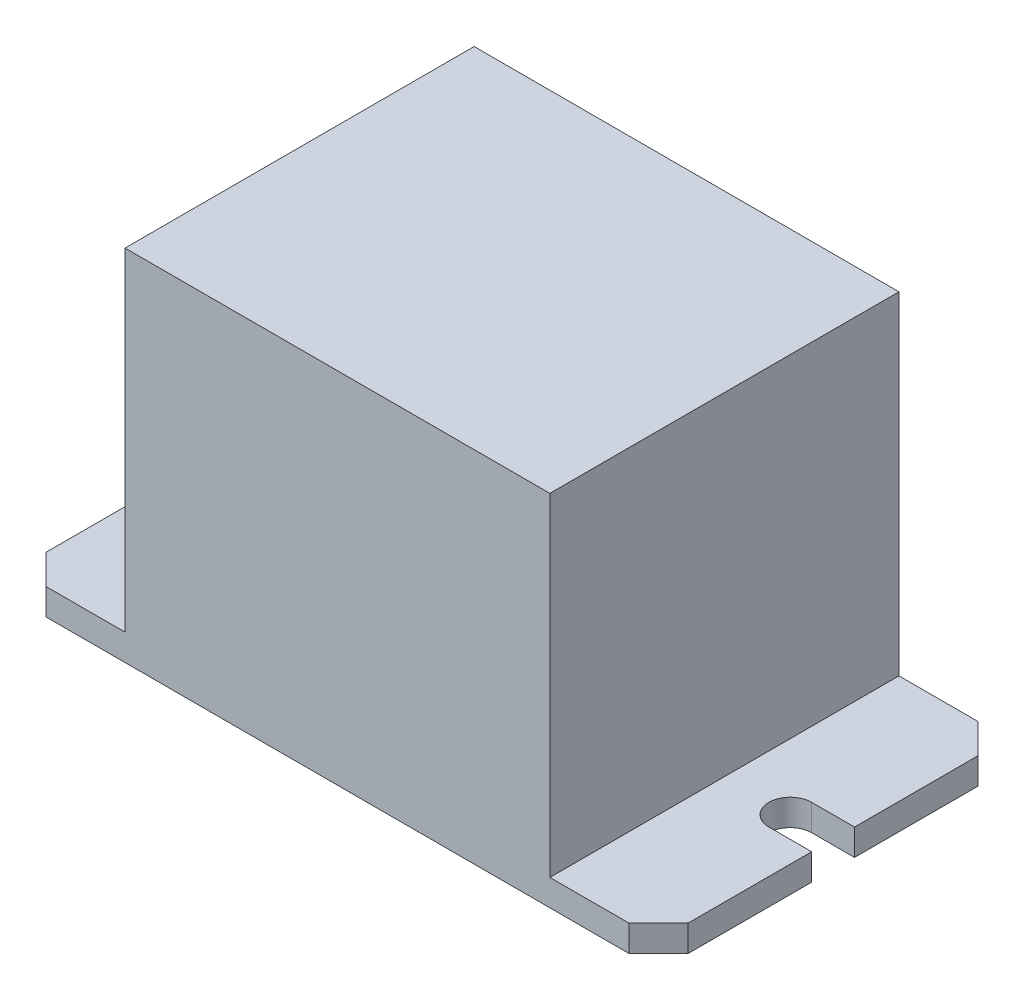
ISO-10303-21;
HEADER;
FILE_DESCRIPTION(('STEP AP214'),'2;1');
FILE_NAME('part.step','',(''),(''),'','','');
FILE_SCHEMA(('AUTOMOTIVE_DESIGN { 1 0 10303 214 1 1 1 1 }'));
ENDSEC;
DATA;
#1=APPLICATION_CONTEXT('core data for automotive mechanical design processes');
#2=APPLICATION_PROTOCOL_DEFINITION('international standard','automotive_design',2000,#1);
#3=PRODUCT_CONTEXT('',#1,'mechanical');
#4=PRODUCT('Part','Part','',(#3));
#5=PRODUCT_RELATED_PRODUCT_CATEGORY('part','',(#4));
#6=PRODUCT_DEFINITION_FORMATION('','',#4);
#7=PRODUCT_DEFINITION_CONTEXT('part definition',#1,'design');
#8=PRODUCT_DEFINITION('design','',#6,#7);
#9=PRODUCT_DEFINITION_SHAPE('','',#8);
#10=(LENGTH_UNIT() NAMED_UNIT(*) SI_UNIT(.MILLI.,.METRE.));
#11=(NAMED_UNIT(*) PLANE_ANGLE_UNIT() SI_UNIT($,.RADIAN.));
#12=(NAMED_UNIT(*) SI_UNIT($,.STERADIAN.) SOLID_ANGLE_UNIT());
#13=UNCERTAINTY_MEASURE_WITH_UNIT(LENGTH_MEASURE(1.E-05),#10,'distance_accuracy_value','');
#14=(GEOMETRIC_REPRESENTATION_CONTEXT(3) GLOBAL_UNCERTAINTY_ASSIGNED_CONTEXT((#13)) GLOBAL_UNIT_ASSIGNED_CONTEXT((#10,
#11,#12)) REPRESENTATION_CONTEXT('',''));
#15=CARTESIAN_POINT('',(0.,0.,0.));
#16=DIRECTION('',(0.,0.,1.));
#17=DIRECTION('',(1.,0.,0.));
#18=AXIS2_PLACEMENT_3D('',#15,#16,#17);
#19=CARTESIAN_POINT('',(-18.0292306975485,27.686,13.5258599301605));
#20=DIRECTION('',(0.,0.,-1.));
#21=DIRECTION('',(-1.,0.,0.));
#22=AXIS2_PLACEMENT_3D('',#19,#20,#21);
#23=PLANE('',#22);
#24=DIRECTION('',(1.,0.,0.));
#25=VECTOR('',#24,1.);
#26=CARTESIAN_POINT('',(-18.0292306975485,0.,13.5258599301605));
#27=LINE('',#26,#25);
#28=CARTESIAN_POINT('',(-24.1252306975485,0.,13.5258599301605));
#29=VERTEX_POINT('',#28);
#30=CARTESIAN_POINT('',(20.8327693024515,0.,13.5258599301605));
#31=VERTEX_POINT('',#30);
#32=EDGE_CURVE('E319',#29,#31,#27,.T.);
#33=ORIENTED_EDGE('',*,*,#32,.T.);
#34=DIRECTION('',(0.,-1.,0.));
#35=VECTOR('',#34,1.);
#36=CARTESIAN_POINT('',(20.8327693024515,2.032,13.5258599301605));
#37=LINE('',#36,#35);
#38=CARTESIAN_POINT('',(20.8327693024515,2.032,13.5258599301605));
#39=VERTEX_POINT('',#38);
#40=EDGE_CURVE('E248',#39,#31,#37,.T.);
#41=ORIENTED_EDGE('',*,*,#40,.F.);
#42=DIRECTION('',(-1.,0.,0.));
#43=VECTOR('',#42,1.);
#44=CARTESIAN_POINT('',(20.8327693024515,2.032,13.5258599301605));
#45=LINE('',#44,#43);
#46=CARTESIAN_POINT('',(14.7367693024515,2.032,13.5258599301605));
#47=VERTEX_POINT('',#46);
#48=EDGE_CURVE('E221',#39,#47,#45,.T.);
#49=ORIENTED_EDGE('',*,*,#48,.T.);
#50=DIRECTION('',(0.,-1.,0.));
#51=VECTOR('',#50,1.);
#52=CARTESIAN_POINT('',(14.7367693024515,27.686,13.5258599301605));
#53=LINE('',#52,#51);
#54=CARTESIAN_POINT('',(14.7367693024515,27.686,13.5258599301605));
#55=VERTEX_POINT('',#54);
#56=EDGE_CURVE('E11',#55,#47,#53,.T.);
#57=ORIENTED_EDGE('',*,*,#56,.F.);
#58=DIRECTION('',(1.,0.,0.));
#59=VECTOR('',#58,1.);
#60=CARTESIAN_POINT('',(-18.0292306975485,27.686,13.5258599301605));
#61=LINE('',#60,#59);
#62=CARTESIAN_POINT('',(-18.0292306975485,27.686,13.5258599301605));
#63=VERTEX_POINT('',#62);
#64=EDGE_CURVE('E320',#63,#55,#61,.T.);
#65=ORIENTED_EDGE('',*,*,#64,.F.);
#66=DIRECTION('',(0.,-1.,0.));
#67=VECTOR('',#66,1.);
#68=CARTESIAN_POINT('',(-18.0292306975485,27.686,13.5258599301605));
#69=LINE('',#68,#67);
#70=CARTESIAN_POINT('',(-18.0292306975485,2.032,13.5258599301605));
#71=VERTEX_POINT('',#70);
#72=EDGE_CURVE('E331',#63,#71,#69,.T.);
#73=ORIENTED_EDGE('',*,*,#72,.T.);
#74=DIRECTION('',(1.,0.,0.));
#75=VECTOR('',#74,1.);
#76=CARTESIAN_POINT('',(-24.1252306975485,2.032,13.5258599301605));
#77=LINE('',#76,#75);
#78=CARTESIAN_POINT('',(-24.1252306975485,2.032,13.5258599301605));
#79=VERTEX_POINT('',#78);
#80=EDGE_CURVE('E64',#79,#71,#77,.T.);
#81=ORIENTED_EDGE('',*,*,#80,.F.);
#82=DIRECTION('',(0.,-1.,0.));
#83=VECTOR('',#82,1.);
#84=CARTESIAN_POINT('',(-24.1252306975485,2.032,13.5258599301605));
#85=LINE('',#84,#83);
#86=EDGE_CURVE('E314',#79,#29,#85,.T.);
#87=ORIENTED_EDGE('',*,*,#86,.T.);
#88=EDGE_LOOP('',(#33,#41,#49,#57,#65,#73,#81,#87));
#89=FACE_BOUND('',#88,.T.);
#90=ADVANCED_FACE('F43',(#89),#23,.F.);
#91=CARTESIAN_POINT('',(14.7367693024515,27.686,-13.3981400698395));
#92=DIRECTION('',(1.,0.,0.));
#93=DIRECTION('',(0.,0.,-1.));
#94=AXIS2_PLACEMENT_3D('',#91,#92,#93);
#95=PLANE('',#94);
#96=DIRECTION('',(0.,0.,1.));
#97=VECTOR('',#96,1.);
#98=CARTESIAN_POINT('',(14.7367693024515,2.032,-13.3981400698395));
#99=LINE('',#98,#97);
#100=CARTESIAN_POINT('',(14.7367693024515,2.032,-13.3981400698395));
#101=VERTEX_POINT('',#100);
#102=EDGE_CURVE('E56',#101,#47,#99,.T.);
#103=ORIENTED_EDGE('',*,*,#102,.F.);
#104=DIRECTION('',(0.,-1.,0.));
#105=VECTOR('',#104,1.);
#106=CARTESIAN_POINT('',(14.7367693024515,27.686,-13.3981400698395));
#107=LINE('',#106,#105);
#108=CARTESIAN_POINT('',(14.7367693024515,27.686,-13.3981400698395));
#109=VERTEX_POINT('',#108);
#110=EDGE_CURVE('E50',#109,#101,#107,.T.);
#111=ORIENTED_EDGE('',*,*,#110,.F.);
#112=DIRECTION('',(0.,0.,1.));
#113=VECTOR('',#112,1.);
#114=CARTESIAN_POINT('',(14.7367693024515,27.686,-13.3981400698395));
#115=LINE('',#114,#113);
#116=EDGE_CURVE('E322',#109,#55,#115,.T.);
#117=ORIENTED_EDGE('',*,*,#116,.T.);
#118=ORIENTED_EDGE('',*,*,#56,.T.);
#119=EDGE_LOOP('',(#103,#111,#117,#118));
#120=FACE_BOUND('',#119,.T.);
#121=ADVANCED_FACE('F372',(#120),#95,.T.);
#122=CARTESIAN_POINT('',(-18.0292306975485,27.686,-13.3981400698395));
#123=DIRECTION('',(0.,0.,-1.));
#124=DIRECTION('',(-1.,0.,0.));
#125=AXIS2_PLACEMENT_3D('',#122,#123,#124);
#126=PLANE('',#125);
#127=DIRECTION('',(1.,0.,0.));
#128=VECTOR('',#127,1.);
#129=CARTESIAN_POINT('',(-18.0292306975485,0.,-13.3981400698395));
#130=LINE('',#129,#128);
#131=CARTESIAN_POINT('',(-24.1252306975485,0.,-13.3981400698395));
#132=VERTEX_POINT('',#131);
#133=CARTESIAN_POINT('',(20.8327693024515,0.,-13.3981400698395));
#134=VERTEX_POINT('',#133);
#135=EDGE_CURVE('E323',#132,#134,#130,.T.);
#136=ORIENTED_EDGE('',*,*,#135,.F.);
#137=DIRECTION('',(0.,-1.,0.));
#138=VECTOR('',#137,1.);
#139=CARTESIAN_POINT('',(-24.1252306975485,2.032,-13.3981400698395));
#140=LINE('',#139,#138);
#141=CARTESIAN_POINT('',(-24.1252306975485,2.032,-13.3981400698395));
#142=VERTEX_POINT('',#141);
#143=EDGE_CURVE('E311',#142,#132,#140,.T.);
#144=ORIENTED_EDGE('',*,*,#143,.F.);
#145=DIRECTION('',(1.,0.,0.));
#146=VECTOR('',#145,1.);
#147=CARTESIAN_POINT('',(-24.1252306975485,2.032,-13.3981400698395));
#148=LINE('',#147,#146);
#149=CARTESIAN_POINT('',(-18.0292306975485,2.032,-13.3981400698395));
#150=VERTEX_POINT('',#149);
#151=EDGE_CURVE('E267',#142,#150,#148,.T.);
#152=ORIENTED_EDGE('',*,*,#151,.T.);
#153=DIRECTION('',(0.,-1.,0.));
#154=VECTOR('',#153,1.);
#155=CARTESIAN_POINT('',(-18.0292306975485,27.686,-13.3981400698395));
#156=LINE('',#155,#154);
#157=CARTESIAN_POINT('',(-18.0292306975485,27.686,-13.3981400698395));
#158=VERTEX_POINT('',#157);
#159=EDGE_CURVE('E336',#158,#150,#156,.T.);
#160=ORIENTED_EDGE('',*,*,#159,.F.);
#161=DIRECTION('',(1.,0.,0.));
#162=VECTOR('',#161,1.);
#163=CARTESIAN_POINT('',(-18.0292306975485,27.686,-13.3981400698395));
#164=LINE('',#163,#162);
#165=EDGE_CURVE('E326',#158,#109,#164,.T.);
#166=ORIENTED_EDGE('',*,*,#165,.T.);
#167=ORIENTED_EDGE('',*,*,#110,.T.);
#168=DIRECTION('',(1.,0.,0.));
#169=VECTOR('',#168,1.);
#170=CARTESIAN_POINT('',(14.7367693024515,2.032,-13.3981400698395));
#171=LINE('',#170,#169);
#172=CARTESIAN_POINT('',(20.8327693024515,2.032,-13.3981400698395));
#173=VERTEX_POINT('',#172);
#174=EDGE_CURVE('E225',#101,#173,#171,.T.);
#175=ORIENTED_EDGE('',*,*,#174,.T.);
#176=DIRECTION('',(0.,-1.,0.));
#177=VECTOR('',#176,1.);
#178=CARTESIAN_POINT('',(20.8327693024515,2.032,-13.3981400698395));
#179=LINE('',#178,#177);
#180=EDGE_CURVE('E245',#173,#134,#179,.T.);
#181=ORIENTED_EDGE('',*,*,#180,.T.);
#182=EDGE_LOOP('',(#136,#144,#152,#160,#166,#167,#175,#181));
#183=FACE_BOUND('',#182,.T.);
#184=ADVANCED_FACE('F340',(#183),#126,.T.);
#185=CARTESIAN_POINT('',(-18.0292306975485,27.686,-13.3981400698395));
#186=DIRECTION('',(1.,0.,0.));
#187=DIRECTION('',(0.,0.,-1.));
#188=AXIS2_PLACEMENT_3D('',#185,#186,#187);
#189=PLANE('',#188);
#190=ORIENTED_EDGE('',*,*,#159,.T.);
#191=DIRECTION('',(0.,0.,1.));
#192=VECTOR('',#191,1.);
#193=CARTESIAN_POINT('',(-18.0292306975485,2.032,-13.3981400698395));
#194=LINE('',#193,#192);
#195=EDGE_CURVE('E265',#150,#71,#194,.T.);
#196=ORIENTED_EDGE('',*,*,#195,.T.);
#197=ORIENTED_EDGE('',*,*,#72,.F.);
#198=DIRECTION('',(0.,0.,1.));
#199=VECTOR('',#198,1.);
#200=CARTESIAN_POINT('',(-18.0292306975485,27.686,-13.3981400698395));
#201=LINE('',#200,#199);
#202=EDGE_CURVE('E329',#158,#63,#201,.T.);
#203=ORIENTED_EDGE('',*,*,#202,.F.);
#204=EDGE_LOOP('',(#190,#196,#197,#203));
#205=FACE_BOUND('',#204,.T.);
#206=ADVANCED_FACE('F366',(#205),#189,.F.);
#207=CARTESIAN_POINT('',(0.,27.686,0.));
#208=DIRECTION('',(0.,-1.,0.));
#209=DIRECTION('',(0.,0.,-1.));
#210=AXIS2_PLACEMENT_3D('',#207,#208,#209);
#211=PLANE('',#210);
#212=ORIENTED_EDGE('',*,*,#64,.T.);
#213=ORIENTED_EDGE('',*,*,#116,.F.);
#214=ORIENTED_EDGE('',*,*,#165,.F.);
#215=ORIENTED_EDGE('',*,*,#202,.T.);
#216=EDGE_LOOP('',(#212,#213,#214,#215));
#217=FACE_BOUND('',#216,.T.);
#218=ADVANCED_FACE('F370',(#217),#211,.F.);
#219=CARTESIAN_POINT('',(0.,0.,0.));
#220=DIRECTION('',(0.,-1.,0.));
#221=DIRECTION('',(0.,0.,-1.));
#222=AXIS2_PLACEMENT_3D('',#219,#220,#221);
#223=PLANE('',#222);
#224=ORIENTED_EDGE('',*,*,#32,.F.);
#225=DIRECTION('',(-0.707106781186548,0.,-0.707106781186547));
#226=VECTOR('',#225,1.);
#227=CARTESIAN_POINT('',(-24.1252306975485,0.,13.5258599301605));
#228=LINE('',#227,#226);
#229=CARTESIAN_POINT('',(-26.4112306975485,0.,11.2398599301605));
#230=VERTEX_POINT('',#229);
#231=EDGE_CURVE('E285',#29,#230,#228,.T.);
#232=ORIENTED_EDGE('',*,*,#231,.T.);
#233=DIRECTION('',(0.,0.,1.));
#234=VECTOR('',#233,1.);
#235=CARTESIAN_POINT('',(-26.4112306975485,0.,1.71485993016048));
#236=LINE('',#235,#234);
#237=CARTESIAN_POINT('',(-26.4112306975485,0.,1.71485993016048));
#238=VERTEX_POINT('',#237);
#239=EDGE_CURVE('E244',#238,#230,#236,.T.);
#240=ORIENTED_EDGE('',*,*,#239,.F.);
#241=DIRECTION('',(-1.,0.,0.));
#242=VECTOR('',#241,1.);
#243=CARTESIAN_POINT('',(-23.1092306975485,0.,1.71485993016048));
#244=LINE('',#243,#242);
#245=CARTESIAN_POINT('',(-23.1092306975485,0.,1.71485993016048));
#246=VERTEX_POINT('',#245);
#247=EDGE_CURVE('E261',#246,#238,#244,.T.);
#248=ORIENTED_EDGE('',*,*,#247,.F.);
#249=CARTESIAN_POINT('',(-23.1092306975485,0.,0.0638599301604782));
#250=DIRECTION('',(0.,1.,0.));
#251=DIRECTION('',(0.,0.,1.));
#252=AXIS2_PLACEMENT_3D('',#249,#250,#251);
#253=CIRCLE('',#252,1.651);
#254=CARTESIAN_POINT('',(-23.1092306975485,0.,-1.58714006983952));
#255=VERTEX_POINT('',#254);
#256=EDGE_CURVE('E296',#246,#255,#253,.T.);
#257=ORIENTED_EDGE('',*,*,#256,.T.);
#258=DIRECTION('',(-1.,0.,0.));
#259=VECTOR('',#258,1.);
#260=CARTESIAN_POINT('',(-23.1092306975485,0.,-1.58714006983952));
#261=LINE('',#260,#259);
#262=CARTESIAN_POINT('',(-26.4112306975485,0.,-1.58714006983952));
#263=VERTEX_POINT('',#262);
#264=EDGE_CURVE('E293',#255,#263,#261,.T.);
#265=ORIENTED_EDGE('',*,*,#264,.T.);
#266=DIRECTION('',(0.,0.,1.));
#267=VECTOR('',#266,1.);
#268=CARTESIAN_POINT('',(-26.4112306975485,0.,-11.1121400698395));
#269=LINE('',#268,#267);
#270=CARTESIAN_POINT('',(-26.4112306975485,0.,-11.1121400698395));
#271=VERTEX_POINT('',#270);
#272=EDGE_CURVE('E290',#271,#263,#269,.T.);
#273=ORIENTED_EDGE('',*,*,#272,.F.);
#274=DIRECTION('',(-0.707106781186548,0.,0.707106781186548));
#275=VECTOR('',#274,1.);
#276=CARTESIAN_POINT('',(-24.1252306975485,0.,-13.3981400698395));
#277=LINE('',#276,#275);
#278=EDGE_CURVE('E288',#132,#271,#277,.T.);
#279=ORIENTED_EDGE('',*,*,#278,.F.);
#280=ORIENTED_EDGE('',*,*,#135,.T.);
#281=DIRECTION('',(0.707106781186547,0.,0.707106781186548));
#282=VECTOR('',#281,1.);
#283=CARTESIAN_POINT('',(20.8327693024515,0.,-13.3981400698395));
#284=LINE('',#283,#282);
#285=CARTESIAN_POINT('',(23.1187693024515,0.,-11.1121400698395));
#286=VERTEX_POINT('',#285);
#287=EDGE_CURVE('E205',#134,#286,#284,.T.);
#288=ORIENTED_EDGE('',*,*,#287,.T.);
#289=DIRECTION('',(0.,0.,1.));
#290=VECTOR('',#289,1.);
#291=CARTESIAN_POINT('',(23.1187693024515,0.,-11.1121400698395));
#292=LINE('',#291,#290);
#293=CARTESIAN_POINT('',(23.1187693024515,0.,-1.58714006983952));
#294=VERTEX_POINT('',#293);
#295=EDGE_CURVE('E229',#286,#294,#292,.T.);
#296=ORIENTED_EDGE('',*,*,#295,.T.);
#297=DIRECTION('',(1.,0.,0.));
#298=VECTOR('',#297,1.);
#299=CARTESIAN_POINT('',(19.8167693024515,0.,-1.58714006983953));
#300=LINE('',#299,#298);
#301=CARTESIAN_POINT('',(19.8167693024515,0.,-1.58714006983953));
#302=VERTEX_POINT('',#301);
#303=EDGE_CURVE('E196',#302,#294,#300,.T.);
#304=ORIENTED_EDGE('',*,*,#303,.F.);
#305=CARTESIAN_POINT('',(19.8167693024515,0.,0.0638599301604736));
#306=DIRECTION('',(0.,1.,0.));
#307=DIRECTION('',(0.,0.,1.));
#308=AXIS2_PLACEMENT_3D('',#305,#306,#307);
#309=CIRCLE('',#308,1.651);
#310=CARTESIAN_POINT('',(19.8167693024515,0.,1.71485993016047));
#311=VERTEX_POINT('',#310);
#312=EDGE_CURVE('E232',#302,#311,#309,.T.);
#313=ORIENTED_EDGE('',*,*,#312,.T.);
#314=DIRECTION('',(1.,0.,0.));
#315=VECTOR('',#314,1.);
#316=CARTESIAN_POINT('',(19.8167693024515,0.,1.71485993016047));
#317=LINE('',#316,#315);
#318=CARTESIAN_POINT('',(23.1187693024515,0.,1.71485993016048));
#319=VERTEX_POINT('',#318);
#320=EDGE_CURVE('E235',#311,#319,#317,.T.);
#321=ORIENTED_EDGE('',*,*,#320,.T.);
#322=DIRECTION('',(0.,0.,1.));
#323=VECTOR('',#322,1.);
#324=CARTESIAN_POINT('',(23.1187693024515,0.,1.71485993016048));
#325=LINE('',#324,#323);
#326=CARTESIAN_POINT('',(23.1187693024515,0.,11.2398599301605));
#327=VERTEX_POINT('',#326);
#328=EDGE_CURVE('E238',#319,#327,#325,.T.);
#329=ORIENTED_EDGE('',*,*,#328,.T.);
#330=DIRECTION('',(-0.707106781186549,0.,0.707106781186546));
#331=VECTOR('',#330,1.);
#332=CARTESIAN_POINT('',(23.1187693024515,0.,11.2398599301605));
#333=LINE('',#332,#331);
#334=EDGE_CURVE('E208',#327,#31,#333,.T.);
#335=ORIENTED_EDGE('',*,*,#334,.T.);
#336=EDGE_LOOP('',(#224,#232,#240,#248,#257,#265,#273,#279,#280,#288,#296,#304,#313,#321,#329,#335));
#337=FACE_BOUND('',#336,.T.);
#338=ADVANCED_FACE('F355',(#337),#223,.T.);
#339=CARTESIAN_POINT('',(-26.4112306975485,2.032,1.71485993016048));
#340=DIRECTION('',(1.,0.,0.));
#341=DIRECTION('',(0.,0.,-1.));
#342=AXIS2_PLACEMENT_3D('',#339,#340,#341);
#343=PLANE('',#342);
#344=ORIENTED_EDGE('',*,*,#239,.T.);
#345=DIRECTION('',(0.,-1.,0.));
#346=VECTOR('',#345,1.);
#347=CARTESIAN_POINT('',(-26.4112306975485,2.032,11.2398599301605));
#348=LINE('',#347,#346);
#349=CARTESIAN_POINT('',(-26.4112306975485,2.032,11.2398599301605));
#350=VERTEX_POINT('',#349);
#351=EDGE_CURVE('E317',#350,#230,#348,.T.);
#352=ORIENTED_EDGE('',*,*,#351,.F.);
#353=DIRECTION('',(0.,0.,1.));
#354=VECTOR('',#353,1.);
#355=CARTESIAN_POINT('',(-26.4112306975485,2.032,1.71485993016048));
#356=LINE('',#355,#354);
#357=CARTESIAN_POINT('',(-26.4112306975485,2.032,1.71485993016048));
#358=VERTEX_POINT('',#357);
#359=EDGE_CURVE('E258',#358,#350,#356,.T.);
#360=ORIENTED_EDGE('',*,*,#359,.F.);
#361=DIRECTION('',(0.,-1.,0.));
#362=VECTOR('',#361,1.);
#363=CARTESIAN_POINT('',(-26.4112306975485,2.032,1.71485993016048));
#364=LINE('',#363,#362);
#365=EDGE_CURVE('E282',#358,#238,#364,.T.);
#366=ORIENTED_EDGE('',*,*,#365,.T.);
#367=EDGE_LOOP('',(#344,#352,#360,#366));
#368=FACE_BOUND('',#367,.T.);
#369=ADVANCED_FACE('F395',(#368),#343,.F.);
#370=CARTESIAN_POINT('',(-24.1252306975485,2.032,13.5258599301605));
#371=DIRECTION('',(-0.707106781186547,0.,0.707106781186548));
#372=DIRECTION('',(0.707106781186548,0.,0.707106781186547));
#373=AXIS2_PLACEMENT_3D('',#370,#371,#372);
#374=PLANE('',#373);
#375=ORIENTED_EDGE('',*,*,#231,.F.);
#376=ORIENTED_EDGE('',*,*,#86,.F.);
#377=DIRECTION('',(-0.707106781186548,0.,-0.707106781186547));
#378=VECTOR('',#377,1.);
#379=CARTESIAN_POINT('',(-24.1252306975485,2.032,13.5258599301605));
#380=LINE('',#379,#378);
#381=EDGE_CURVE('E260',#79,#350,#380,.T.);
#382=ORIENTED_EDGE('',*,*,#381,.T.);
#383=ORIENTED_EDGE('',*,*,#351,.T.);
#384=EDGE_LOOP('',(#375,#376,#382,#383));
#385=FACE_BOUND('',#384,.T.);
#386=ADVANCED_FACE('F391',(#385),#374,.T.);
#387=CARTESIAN_POINT('',(-24.1252306975485,2.032,-13.3981400698395));
#388=DIRECTION('',(0.707106781186548,0.,0.707106781186548));
#389=DIRECTION('',(0.707106781186548,0.,-0.707106781186548));
#390=AXIS2_PLACEMENT_3D('',#387,#388,#389);
#391=PLANE('',#390);
#392=ORIENTED_EDGE('',*,*,#278,.T.);
#393=DIRECTION('',(0.,-1.,0.));
#394=VECTOR('',#393,1.);
#395=CARTESIAN_POINT('',(-26.4112306975485,2.032,-11.1121400698395));
#396=LINE('',#395,#394);
#397=CARTESIAN_POINT('',(-26.4112306975485,2.032,-11.1121400698395));
#398=VERTEX_POINT('',#397);
#399=EDGE_CURVE('E308',#398,#271,#396,.T.);
#400=ORIENTED_EDGE('',*,*,#399,.F.);
#401=DIRECTION('',(-0.707106781186548,0.,0.707106781186548));
#402=VECTOR('',#401,1.);
#403=CARTESIAN_POINT('',(-24.1252306975485,2.032,-13.3981400698395));
#404=LINE('',#403,#402);
#405=EDGE_CURVE('E270',#142,#398,#404,.T.);
#406=ORIENTED_EDGE('',*,*,#405,.F.);
#407=ORIENTED_EDGE('',*,*,#143,.T.);
#408=EDGE_LOOP('',(#392,#400,#406,#407));
#409=FACE_BOUND('',#408,.T.);
#410=ADVANCED_FACE('F351',(#409),#391,.F.);
#411=CARTESIAN_POINT('',(-26.4112306975485,2.032,-11.1121400698395));
#412=DIRECTION('',(1.,0.,0.));
#413=DIRECTION('',(0.,0.,-1.));
#414=AXIS2_PLACEMENT_3D('',#411,#412,#413);
#415=PLANE('',#414);
#416=ORIENTED_EDGE('',*,*,#272,.T.);
#417=DIRECTION('',(0.,-1.,0.));
#418=VECTOR('',#417,1.);
#419=CARTESIAN_POINT('',(-26.4112306975485,2.032,-1.58714006983952));
#420=LINE('',#419,#418);
#421=CARTESIAN_POINT('',(-26.4112306975485,2.032,-1.58714006983952));
#422=VERTEX_POINT('',#421);
#423=EDGE_CURVE('E306',#422,#263,#420,.T.);
#424=ORIENTED_EDGE('',*,*,#423,.F.);
#425=DIRECTION('',(0.,0.,1.));
#426=VECTOR('',#425,1.);
#427=CARTESIAN_POINT('',(-26.4112306975485,2.032,-11.1121400698395));
#428=LINE('',#427,#426);
#429=EDGE_CURVE('E272',#398,#422,#428,.T.);
#430=ORIENTED_EDGE('',*,*,#429,.F.);
#431=ORIENTED_EDGE('',*,*,#399,.T.);
#432=EDGE_LOOP('',(#416,#424,#430,#431));
#433=FACE_BOUND('',#432,.T.);
#434=ADVANCED_FACE('F359',(#433),#415,.F.);
#435=CARTESIAN_POINT('',(-23.1092306975485,2.032,-1.58714006983952));
#436=DIRECTION('',(0.,0.,1.));
#437=DIRECTION('',(1.,0.,0.));
#438=AXIS2_PLACEMENT_3D('',#435,#436,#437);
#439=PLANE('',#438);
#440=ORIENTED_EDGE('',*,*,#264,.F.);
#441=DIRECTION('',(0.,-1.,0.));
#442=VECTOR('',#441,1.);
#443=CARTESIAN_POINT('',(-23.1092306975485,2.032,-1.58714006983952));
#444=LINE('',#443,#442);
#445=CARTESIAN_POINT('',(-23.1092306975485,2.032,-1.58714006983952));
#446=VERTEX_POINT('',#445);
#447=EDGE_CURVE('E304',#446,#255,#444,.T.);
#448=ORIENTED_EDGE('',*,*,#447,.F.);
#449=DIRECTION('',(-1.,0.,0.));
#450=VECTOR('',#449,1.);
#451=CARTESIAN_POINT('',(-23.1092306975485,2.032,-1.58714006983952));
#452=LINE('',#451,#450);
#453=EDGE_CURVE('E274',#446,#422,#452,.T.);
#454=ORIENTED_EDGE('',*,*,#453,.T.);
#455=ORIENTED_EDGE('',*,*,#423,.T.);
#456=EDGE_LOOP('',(#440,#448,#454,#455));
#457=FACE_BOUND('',#456,.T.);
#458=ADVANCED_FACE('F404',(#457),#439,.T.);
#459=CARTESIAN_POINT('',(-23.1092306975485,2.032,0.0638599301604782));
#460=DIRECTION('',(0.,-1.,0.));
#461=DIRECTION('',(0.,0.,-1.));
#462=AXIS2_PLACEMENT_3D('',#459,#460,#461);
#463=CYLINDRICAL_SURFACE('',#462,1.651);
#464=ORIENTED_EDGE('',*,*,#256,.F.);
#465=DIRECTION('',(0.,-1.,0.));
#466=VECTOR('',#465,1.);
#467=CARTESIAN_POINT('',(-23.1092306975485,2.032,1.71485993016048));
#468=LINE('',#467,#466);
#469=CARTESIAN_POINT('',(-23.1092306975485,2.032,1.71485993016048));
#470=VERTEX_POINT('',#469);
#471=EDGE_CURVE('E302',#470,#246,#468,.T.);
#472=ORIENTED_EDGE('',*,*,#471,.F.);
#473=CARTESIAN_POINT('',(-23.1092306975485,2.032,0.0638599301604782));
#474=DIRECTION('',(0.,1.,0.));
#475=DIRECTION('',(0.,0.,1.));
#476=AXIS2_PLACEMENT_3D('',#473,#474,#475);
#477=CIRCLE('',#476,1.651);
#478=EDGE_CURVE('E277',#470,#446,#477,.T.);
#479=ORIENTED_EDGE('',*,*,#478,.T.);
#480=ORIENTED_EDGE('',*,*,#447,.T.);
#481=EDGE_LOOP('',(#464,#472,#479,#480));
#482=FACE_BOUND('',#481,.T.);
#483=ADVANCED_FACE('F401',(#482),#463,.F.);
#484=CARTESIAN_POINT('',(-23.1092306975485,2.032,1.71485993016048));
#485=DIRECTION('',(0.,0.,1.));
#486=DIRECTION('',(1.,0.,0.));
#487=AXIS2_PLACEMENT_3D('',#484,#485,#486);
#488=PLANE('',#487);
#489=ORIENTED_EDGE('',*,*,#247,.T.);
#490=ORIENTED_EDGE('',*,*,#365,.F.);
#491=DIRECTION('',(-1.,0.,0.));
#492=VECTOR('',#491,1.);
#493=CARTESIAN_POINT('',(-23.1092306975485,2.032,1.71485993016048));
#494=LINE('',#493,#492);
#495=EDGE_CURVE('E280',#470,#358,#494,.T.);
#496=ORIENTED_EDGE('',*,*,#495,.F.);
#497=ORIENTED_EDGE('',*,*,#471,.T.);
#498=EDGE_LOOP('',(#489,#490,#496,#497));
#499=FACE_BOUND('',#498,.T.);
#500=ADVANCED_FACE('F411',(#499),#488,.F.);
#501=CARTESIAN_POINT('',(-23.1092306975485,2.032,0.0638599301604782));
#502=DIRECTION('',(0.,1.,0.));
#503=DIRECTION('',(0.,0.,1.));
#504=AXIS2_PLACEMENT_3D('',#501,#502,#503);
#505=PLANE('',#504);
#506=ORIENTED_EDGE('',*,*,#359,.T.);
#507=ORIENTED_EDGE('',*,*,#381,.F.);
#508=ORIENTED_EDGE('',*,*,#80,.T.);
#509=ORIENTED_EDGE('',*,*,#195,.F.);
#510=ORIENTED_EDGE('',*,*,#151,.F.);
#511=ORIENTED_EDGE('',*,*,#405,.T.);
#512=ORIENTED_EDGE('',*,*,#429,.T.);
#513=ORIENTED_EDGE('',*,*,#453,.F.);
#514=ORIENTED_EDGE('',*,*,#478,.F.);
#515=ORIENTED_EDGE('',*,*,#495,.T.);
#516=EDGE_LOOP('',(#506,#507,#508,#509,#510,#511,#512,#513,#514,#515));
#517=FACE_BOUND('',#516,.T.);
#518=ADVANCED_FACE('F362',(#517),#505,.T.);
#519=CARTESIAN_POINT('',(23.1187693024515,2.032,-11.1121400698395));
#520=DIRECTION('',(1.,0.,0.));
#521=DIRECTION('',(0.,0.,-1.));
#522=AXIS2_PLACEMENT_3D('',#519,#520,#521);
#523=PLANE('',#522);
#524=ORIENTED_EDGE('',*,*,#295,.F.);
#525=DIRECTION('',(0.,-1.,0.));
#526=VECTOR('',#525,1.);
#527=CARTESIAN_POINT('',(23.1187693024515,2.032,-11.1121400698395));
#528=LINE('',#527,#526);
#529=CARTESIAN_POINT('',(23.1187693024515,2.032,-11.1121400698395));
#530=VERTEX_POINT('',#529);
#531=EDGE_CURVE('E204',#530,#286,#528,.T.);
#532=ORIENTED_EDGE('',*,*,#531,.F.);
#533=DIRECTION('',(0.,0.,1.));
#534=VECTOR('',#533,1.);
#535=CARTESIAN_POINT('',(23.1187693024515,2.032,-11.1121400698395));
#536=LINE('',#535,#534);
#537=CARTESIAN_POINT('',(23.1187693024515,2.032,-1.58714006983952));
#538=VERTEX_POINT('',#537);
#539=EDGE_CURVE('E185',#530,#538,#536,.T.);
#540=ORIENTED_EDGE('',*,*,#539,.T.);
#541=DIRECTION('',(0.,-1.,0.));
#542=VECTOR('',#541,1.);
#543=CARTESIAN_POINT('',(23.1187693024515,2.032,-1.58714006983952));
#544=LINE('',#543,#542);
#545=EDGE_CURVE('E193',#538,#294,#544,.T.);
#546=ORIENTED_EDGE('',*,*,#545,.T.);
#547=EDGE_LOOP('',(#524,#532,#540,#546));
#548=FACE_BOUND('',#547,.T.);
#549=ADVANCED_FACE('F203',(#548),#523,.T.);
#550=CARTESIAN_POINT('',(20.8327693024515,2.032,-13.3981400698395));
#551=DIRECTION('',(0.707106781186548,0.,-0.707106781186547));
#552=DIRECTION('',(-0.707106781186547,0.,-0.707106781186548));
#553=AXIS2_PLACEMENT_3D('',#550,#551,#552);
#554=PLANE('',#553);
#555=ORIENTED_EDGE('',*,*,#287,.F.);
#556=ORIENTED_EDGE('',*,*,#180,.F.);
#557=DIRECTION('',(0.707106781186547,0.,0.707106781186548));
#558=VECTOR('',#557,1.);
#559=CARTESIAN_POINT('',(20.8327693024515,2.032,-13.3981400698395));
#560=LINE('',#559,#558);
#561=EDGE_CURVE('E201',#173,#530,#560,.T.);
#562=ORIENTED_EDGE('',*,*,#561,.T.);
#563=ORIENTED_EDGE('',*,*,#531,.T.);
#564=EDGE_LOOP('',(#555,#556,#562,#563));
#565=FACE_BOUND('',#564,.T.);
#566=ADVANCED_FACE('F346',(#565),#554,.T.);
#567=CARTESIAN_POINT('',(23.1187693024515,2.032,11.2398599301605));
#568=DIRECTION('',(0.707106781186546,0.,0.707106781186549));
#569=DIRECTION('',(0.707106781186549,0.,-0.707106781186546));
#570=AXIS2_PLACEMENT_3D('',#567,#568,#569);
#571=PLANE('',#570);
#572=ORIENTED_EDGE('',*,*,#334,.F.);
#573=DIRECTION('',(0.,-1.,0.));
#574=VECTOR('',#573,1.);
#575=CARTESIAN_POINT('',(23.1187693024515,2.032,11.2398599301605));
#576=LINE('',#575,#574);
#577=CARTESIAN_POINT('',(23.1187693024515,2.032,11.2398599301605));
#578=VERTEX_POINT('',#577);
#579=EDGE_CURVE('E251',#578,#327,#576,.T.);
#580=ORIENTED_EDGE('',*,*,#579,.F.);
#581=DIRECTION('',(-0.707106781186549,0.,0.707106781186546));
#582=VECTOR('',#581,1.);
#583=CARTESIAN_POINT('',(23.1187693024515,2.032,11.2398599301605));
#584=LINE('',#583,#582);
#585=EDGE_CURVE('E218',#578,#39,#584,.T.);
#586=ORIENTED_EDGE('',*,*,#585,.T.);
#587=ORIENTED_EDGE('',*,*,#40,.T.);
#588=EDGE_LOOP('',(#572,#580,#586,#587));
#589=FACE_BOUND('',#588,.T.);
#590=ADVANCED_FACE('F378',(#589),#571,.T.);
#591=CARTESIAN_POINT('',(23.1187693024515,2.032,1.71485993016048));
#592=DIRECTION('',(1.,0.,0.));
#593=DIRECTION('',(0.,0.,-1.));
#594=AXIS2_PLACEMENT_3D('',#591,#592,#593);
#595=PLANE('',#594);
#596=ORIENTED_EDGE('',*,*,#328,.F.);
#597=DIRECTION('',(0.,-1.,0.));
#598=VECTOR('',#597,1.);
#599=CARTESIAN_POINT('',(23.1187693024515,2.032,1.71485993016048));
#600=LINE('',#599,#598);
#601=CARTESIAN_POINT('',(23.1187693024515,2.032,1.71485993016048));
#602=VERTEX_POINT('',#601);
#603=EDGE_CURVE('E253',#602,#319,#600,.T.);
#604=ORIENTED_EDGE('',*,*,#603,.F.);
#605=DIRECTION('',(0.,0.,1.));
#606=VECTOR('',#605,1.);
#607=CARTESIAN_POINT('',(23.1187693024515,2.032,1.71485993016048));
#608=LINE('',#607,#606);
#609=EDGE_CURVE('E215',#602,#578,#608,.T.);
#610=ORIENTED_EDGE('',*,*,#609,.T.);
#611=ORIENTED_EDGE('',*,*,#579,.T.);
#612=EDGE_LOOP('',(#596,#604,#610,#611));
#613=FACE_BOUND('',#612,.T.);
#614=ADVANCED_FACE('F381',(#613),#595,.T.);
#615=CARTESIAN_POINT('',(19.8167693024515,2.032,1.71485993016047));
#616=DIRECTION('',(0.,0.,-1.));
#617=DIRECTION('',(-1.,0.,0.));
#618=AXIS2_PLACEMENT_3D('',#615,#616,#617);
#619=PLANE('',#618);
#620=ORIENTED_EDGE('',*,*,#320,.F.);
#621=DIRECTION('',(0.,-1.,0.));
#622=VECTOR('',#621,1.);
#623=CARTESIAN_POINT('',(19.8167693024515,2.032,1.71485993016047));
#624=LINE('',#623,#622);
#625=CARTESIAN_POINT('',(19.8167693024515,2.032,1.71485993016047));
#626=VERTEX_POINT('',#625);
#627=EDGE_CURVE('E255',#626,#311,#624,.T.);
#628=ORIENTED_EDGE('',*,*,#627,.F.);
#629=DIRECTION('',(1.,0.,0.));
#630=VECTOR('',#629,1.);
#631=CARTESIAN_POINT('',(19.8167693024515,2.032,1.71485993016047));
#632=LINE('',#631,#630);
#633=EDGE_CURVE('E212',#626,#602,#632,.T.);
#634=ORIENTED_EDGE('',*,*,#633,.T.);
#635=ORIENTED_EDGE('',*,*,#603,.T.);
#636=EDGE_LOOP('',(#620,#628,#634,#635));
#637=FACE_BOUND('',#636,.T.);
#638=ADVANCED_FACE('F384',(#637),#619,.T.);
#639=CARTESIAN_POINT('',(19.8167693024515,2.032,0.0638599301604736));
#640=DIRECTION('',(0.,-1.,0.));
#641=DIRECTION('',(0.,0.,-1.));
#642=AXIS2_PLACEMENT_3D('',#639,#640,#641);
#643=CYLINDRICAL_SURFACE('',#642,1.651);
#644=ORIENTED_EDGE('',*,*,#312,.F.);
#645=DIRECTION('',(0.,-1.,0.));
#646=VECTOR('',#645,1.);
#647=CARTESIAN_POINT('',(19.8167693024515,2.032,-1.58714006983953));
#648=LINE('',#647,#646);
#649=CARTESIAN_POINT('',(19.8167693024515,2.032,-1.58714006983953));
#650=VERTEX_POINT('',#649);
#651=EDGE_CURVE('E200',#650,#302,#648,.T.);
#652=ORIENTED_EDGE('',*,*,#651,.F.);
#653=CARTESIAN_POINT('',(19.8167693024515,2.032,0.0638599301604736));
#654=DIRECTION('',(0.,1.,0.));
#655=DIRECTION('',(0.,0.,1.));
#656=AXIS2_PLACEMENT_3D('',#653,#654,#655);
#657=CIRCLE('',#656,1.651);
#658=EDGE_CURVE('E189',#650,#626,#657,.T.);
#659=ORIENTED_EDGE('',*,*,#658,.T.);
#660=ORIENTED_EDGE('',*,*,#627,.T.);
#661=EDGE_LOOP('',(#644,#652,#659,#660));
#662=FACE_BOUND('',#661,.T.);
#663=ADVANCED_FACE('F387',(#662),#643,.F.);
#664=CARTESIAN_POINT('',(19.8167693024515,2.032,-1.58714006983953));
#665=DIRECTION('',(0.,0.,-1.));
#666=DIRECTION('',(-1.,0.,0.));
#667=AXIS2_PLACEMENT_3D('',#664,#665,#666);
#668=PLANE('',#667);
#669=ORIENTED_EDGE('',*,*,#303,.T.);
#670=ORIENTED_EDGE('',*,*,#545,.F.);
#671=DIRECTION('',(1.,0.,0.));
#672=VECTOR('',#671,1.);
#673=CARTESIAN_POINT('',(19.8167693024515,2.032,-1.58714006983953));
#674=LINE('',#673,#672);
#675=EDGE_CURVE('E180',#650,#538,#674,.T.);
#676=ORIENTED_EDGE('',*,*,#675,.F.);
#677=ORIENTED_EDGE('',*,*,#651,.T.);
#678=EDGE_LOOP('',(#669,#670,#676,#677));
#679=FACE_BOUND('',#678,.T.);
#680=ADVANCED_FACE('F194',(#679),#668,.F.);
#681=CARTESIAN_POINT('',(19.8167693024515,2.032,0.0638599301604736));
#682=DIRECTION('',(0.,1.,0.));
#683=DIRECTION('',(0.,0.,1.));
#684=AXIS2_PLACEMENT_3D('',#681,#682,#683);
#685=PLANE('',#684);
#686=ORIENTED_EDGE('',*,*,#539,.F.);
#687=ORIENTED_EDGE('',*,*,#561,.F.);
#688=ORIENTED_EDGE('',*,*,#174,.F.);
#689=ORIENTED_EDGE('',*,*,#102,.T.);
#690=ORIENTED_EDGE('',*,*,#48,.F.);
#691=ORIENTED_EDGE('',*,*,#585,.F.);
#692=ORIENTED_EDGE('',*,*,#609,.F.);
#693=ORIENTED_EDGE('',*,*,#633,.F.);
#694=ORIENTED_EDGE('',*,*,#658,.F.);
#695=ORIENTED_EDGE('',*,*,#675,.T.);
#696=EDGE_LOOP('',(#686,#687,#688,#689,#690,#691,#692,#693,#694,#695));
#697=FACE_BOUND('',#696,.T.);
#698=ADVANCED_FACE('F182',(#697),#685,.T.);
#699=CLOSED_SHELL('',(#90,#121,#184,#206,#218,#338,#369,#386,#410,#434,#458,#483,#500,#518,#549,
#566,#590,#614,#638,#663,#680,#698));
#700=MANIFOLD_SOLID_BREP('B2',#699);
#701=ADVANCED_BREP_SHAPE_REPRESENTATION('',(#18,#700),#14);
#702=SHAPE_DEFINITION_REPRESENTATION(#9,#701);
ENDSEC;
END-ISO-10303-21;
